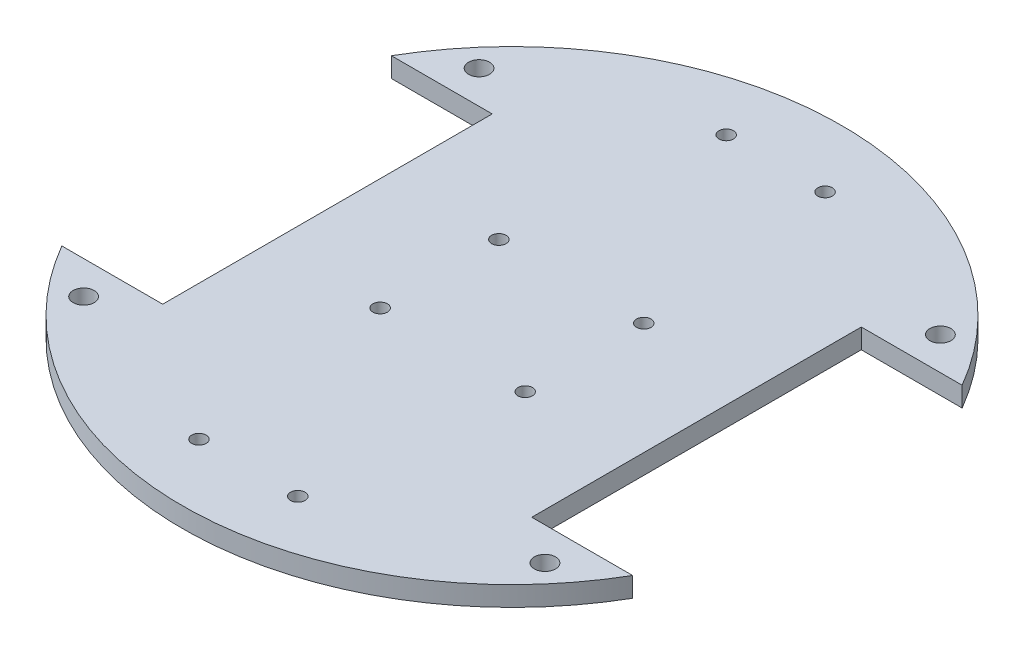
ISO-10303-21;
HEADER;
FILE_DESCRIPTION(('STEP AP214'),'2;1');
FILE_NAME('part.step','',(''),(''),'','','');
FILE_SCHEMA(('AUTOMOTIVE_DESIGN { 1 0 10303 214 1 1 1 1 }'));
ENDSEC;
DATA;
#1=APPLICATION_CONTEXT('core data for automotive mechanical design processes');
#2=APPLICATION_PROTOCOL_DEFINITION('international standard','automotive_design',2000,#1);
#3=PRODUCT_CONTEXT('',#1,'mechanical');
#4=PRODUCT('Part','Part','',(#3));
#5=PRODUCT_RELATED_PRODUCT_CATEGORY('part','',(#4));
#6=PRODUCT_DEFINITION_FORMATION('','',#4);
#7=PRODUCT_DEFINITION_CONTEXT('part definition',#1,'design');
#8=PRODUCT_DEFINITION('design','',#6,#7);
#9=PRODUCT_DEFINITION_SHAPE('','',#8);
#10=(LENGTH_UNIT() NAMED_UNIT(*) SI_UNIT(.MILLI.,.METRE.));
#11=(NAMED_UNIT(*) PLANE_ANGLE_UNIT() SI_UNIT($,.RADIAN.));
#12=(NAMED_UNIT(*) SI_UNIT($,.STERADIAN.) SOLID_ANGLE_UNIT());
#13=UNCERTAINTY_MEASURE_WITH_UNIT(LENGTH_MEASURE(1.E-05),#10,'distance_accuracy_value','');
#14=(GEOMETRIC_REPRESENTATION_CONTEXT(3) GLOBAL_UNCERTAINTY_ASSIGNED_CONTEXT((#13)) GLOBAL_UNIT_ASSIGNED_CONTEXT((#10,
#11,#12)) REPRESENTATION_CONTEXT('',''));
#15=CARTESIAN_POINT('',(0.,0.,0.));
#16=DIRECTION('',(0.,0.,1.));
#17=DIRECTION('',(1.,0.,0.));
#18=AXIS2_PLACEMENT_3D('',#15,#16,#17);
#19=CARTESIAN_POINT('',(0.,3.,0.));
#20=DIRECTION('',(0.,1.,0.));
#21=DIRECTION('',(0.,0.,1.));
#22=AXIS2_PLACEMENT_3D('',#19,#20,#21);
#23=PLANE('',#22);
#24=CARTESIAN_POINT('',(35.,3.,-30.));
#25=DIRECTION('',(0.,1.,0.));
#26=DIRECTION('',(0.,0.,-1.));
#27=AXIS2_PLACEMENT_3D('',#24,#25,#26);
#28=CIRCLE('',#27,1.59999999999999);
#29=CARTESIAN_POINT('',(35.,3.,-31.6));
#30=VERTEX_POINT('',#29);
#31=EDGE_CURVE('E285',#30,#30,#28,.T.);
#32=ORIENTED_EDGE('',*,*,#31,.F.);
#33=EDGE_LOOP('',(#32));
#34=FACE_BOUND('',#33,.T.);
#35=CARTESIAN_POINT('',(-35.,3.,-30.));
#36=DIRECTION('',(0.,1.,0.));
#37=DIRECTION('',(0.,0.,1.));
#38=AXIS2_PLACEMENT_3D('',#35,#36,#37);
#39=CIRCLE('',#38,1.6);
#40=CARTESIAN_POINT('',(-35.,3.,-28.4));
#41=VERTEX_POINT('',#40);
#42=EDGE_CURVE('E269',#41,#41,#39,.T.);
#43=ORIENTED_EDGE('',*,*,#42,.F.);
#44=EDGE_LOOP('',(#43));
#45=FACE_BOUND('',#44,.T.);
#46=CARTESIAN_POINT('',(11.,3.,9.));
#47=DIRECTION('',(0.,1.,0.));
#48=DIRECTION('',(0.,0.,1.));
#49=AXIS2_PLACEMENT_3D('',#46,#47,#48);
#50=CIRCLE('',#49,1.1);
#51=CARTESIAN_POINT('',(11.,3.,10.1));
#52=VERTEX_POINT('',#51);
#53=EDGE_CURVE('E253',#52,#52,#50,.T.);
#54=ORIENTED_EDGE('',*,*,#53,.F.);
#55=EDGE_LOOP('',(#54));
#56=FACE_BOUND('',#55,.T.);
#57=CARTESIAN_POINT('',(7.5,3.,-40.));
#58=DIRECTION('',(0.,1.,0.));
#59=DIRECTION('',(0.,0.,-1.));
#60=AXIS2_PLACEMENT_3D('',#57,#58,#59);
#61=CIRCLE('',#60,1.1);
#62=CARTESIAN_POINT('',(7.5,3.,-41.1));
#63=VERTEX_POINT('',#62);
#64=EDGE_CURVE('E237',#63,#63,#61,.T.);
#65=ORIENTED_EDGE('',*,*,#64,.F.);
#66=EDGE_LOOP('',(#65));
#67=FACE_BOUND('',#66,.T.);
#68=CARTESIAN_POINT('',(-11.,3.,9.));
#69=DIRECTION('',(0.,1.,0.));
#70=DIRECTION('',(0.,0.,-1.));
#71=AXIS2_PLACEMENT_3D('',#68,#69,#70);
#72=CIRCLE('',#71,1.1);
#73=CARTESIAN_POINT('',(-11.,3.,7.9));
#74=VERTEX_POINT('',#73);
#75=EDGE_CURVE('E221',#74,#74,#72,.T.);
#76=ORIENTED_EDGE('',*,*,#75,.F.);
#77=EDGE_LOOP('',(#76));
#78=FACE_BOUND('',#77,.T.);
#79=CARTESIAN_POINT('',(-7.5,3.,40.));
#80=DIRECTION('',(0.,1.,0.));
#81=DIRECTION('',(0.,0.,-1.));
#82=AXIS2_PLACEMENT_3D('',#79,#80,#81);
#83=CIRCLE('',#82,1.1);
#84=CARTESIAN_POINT('',(-7.5,3.,38.9));
#85=VERTEX_POINT('',#84);
#86=EDGE_CURVE('E146',#85,#85,#83,.T.);
#87=ORIENTED_EDGE('',*,*,#86,.F.);
#88=EDGE_LOOP('',(#87));
#89=FACE_BOUND('',#88,.T.);
#90=CARTESIAN_POINT('',(0.,3.,0.));
#91=DIRECTION('',(0.,1.,0.));
#92=DIRECTION('',(0.,0.,1.));
#93=AXIS2_PLACEMENT_3D('',#90,#91,#92);
#94=CIRCLE('',#93,50.);
#95=CARTESIAN_POINT('',(43.3012701892219,3.,-25.));
#96=VERTEX_POINT('',#95);
#97=CARTESIAN_POINT('',(-43.3012701892219,3.,-25.));
#98=VERTEX_POINT('',#97);
#99=EDGE_CURVE('E164',#96,#98,#94,.T.);
#100=ORIENTED_EDGE('',*,*,#99,.T.);
#101=DIRECTION('',(1.,0.,0.));
#102=VECTOR('',#101,1.);
#103=CARTESIAN_POINT('',(-28.,3.,-25.));
#104=LINE('',#103,#102);
#105=CARTESIAN_POINT('',(-28.,3.,-25.));
#106=VERTEX_POINT('',#105);
#107=EDGE_CURVE('E100',#98,#106,#104,.T.);
#108=ORIENTED_EDGE('',*,*,#107,.T.);
#109=DIRECTION('',(0.,0.,1.));
#110=VECTOR('',#109,1.);
#111=CARTESIAN_POINT('',(-28.,3.,-25.));
#112=LINE('',#111,#110);
#113=CARTESIAN_POINT('',(-28.,3.,25.));
#114=VERTEX_POINT('',#113);
#115=EDGE_CURVE('E185',#106,#114,#112,.T.);
#116=ORIENTED_EDGE('',*,*,#115,.T.);
#117=DIRECTION('',(-1.,0.,0.));
#118=VECTOR('',#117,1.);
#119=CARTESIAN_POINT('',(-28.,3.,25.));
#120=LINE('',#119,#118);
#121=CARTESIAN_POINT('',(-43.3012701892219,3.,25.));
#122=VERTEX_POINT('',#121);
#123=EDGE_CURVE('E199',#114,#122,#120,.T.);
#124=ORIENTED_EDGE('',*,*,#123,.T.);
#125=CARTESIAN_POINT('',(0.,3.,0.));
#126=DIRECTION('',(0.,1.,0.));
#127=DIRECTION('',(0.,0.,1.));
#128=AXIS2_PLACEMENT_3D('',#125,#126,#127);
#129=CIRCLE('',#128,50.);
#130=CARTESIAN_POINT('',(43.301270189222,3.,25.));
#131=VERTEX_POINT('',#130);
#132=EDGE_CURVE('E119',#122,#131,#129,.T.);
#133=ORIENTED_EDGE('',*,*,#132,.T.);
#134=DIRECTION('',(-1.,0.,0.));
#135=VECTOR('',#134,1.);
#136=CARTESIAN_POINT('',(43.301270189222,3.,25.));
#137=LINE('',#136,#135);
#138=CARTESIAN_POINT('',(28.,3.,25.));
#139=VERTEX_POINT('',#138);
#140=EDGE_CURVE('E113',#131,#139,#137,.T.);
#141=ORIENTED_EDGE('',*,*,#140,.T.);
#142=DIRECTION('',(0.,0.,-1.));
#143=VECTOR('',#142,1.);
#144=CARTESIAN_POINT('',(28.,3.,-25.));
#145=LINE('',#144,#143);
#146=CARTESIAN_POINT('',(28.,3.,-25.));
#147=VERTEX_POINT('',#146);
#148=EDGE_CURVE('E117',#139,#147,#145,.T.);
#149=ORIENTED_EDGE('',*,*,#148,.T.);
#150=DIRECTION('',(1.,0.,0.));
#151=VECTOR('',#150,1.);
#152=CARTESIAN_POINT('',(28.,3.,-25.));
#153=LINE('',#152,#151);
#154=EDGE_CURVE('E57',#147,#96,#153,.T.);
#155=ORIENTED_EDGE('',*,*,#154,.T.);
#156=EDGE_LOOP('',(#100,#108,#116,#124,#133,#141,#149,#155));
#157=FACE_BOUND('',#156,.T.);
#158=CARTESIAN_POINT('',(-11.,3.,-9.));
#159=DIRECTION('',(0.,1.,0.));
#160=DIRECTION('',(0.,0.,1.));
#161=AXIS2_PLACEMENT_3D('',#158,#159,#160);
#162=CIRCLE('',#161,1.1);
#163=CARTESIAN_POINT('',(-11.,3.,-7.9));
#164=VERTEX_POINT('',#163);
#165=EDGE_CURVE('E213',#164,#164,#162,.T.);
#166=ORIENTED_EDGE('',*,*,#165,.F.);
#167=EDGE_LOOP('',(#166));
#168=FACE_BOUND('',#167,.T.);
#169=CARTESIAN_POINT('',(7.50000000000002,3.,40.));
#170=DIRECTION('',(0.,1.,0.));
#171=DIRECTION('',(0.,0.,1.));
#172=AXIS2_PLACEMENT_3D('',#169,#170,#171);
#173=CIRCLE('',#172,1.1);
#174=CARTESIAN_POINT('',(7.50000000000002,3.,41.1));
#175=VERTEX_POINT('',#174);
#176=EDGE_CURVE('E229',#175,#175,#173,.T.);
#177=ORIENTED_EDGE('',*,*,#176,.F.);
#178=EDGE_LOOP('',(#177));
#179=FACE_BOUND('',#178,.T.);
#180=CARTESIAN_POINT('',(11.,3.,-9.));
#181=DIRECTION('',(0.,1.,0.));
#182=DIRECTION('',(0.,0.,-1.));
#183=AXIS2_PLACEMENT_3D('',#180,#181,#182);
#184=CIRCLE('',#183,1.1);
#185=CARTESIAN_POINT('',(11.,3.,-10.1));
#186=VERTEX_POINT('',#185);
#187=EDGE_CURVE('E245',#186,#186,#184,.T.);
#188=ORIENTED_EDGE('',*,*,#187,.F.);
#189=EDGE_LOOP('',(#188));
#190=FACE_BOUND('',#189,.T.);
#191=CARTESIAN_POINT('',(-7.5,3.,-40.));
#192=DIRECTION('',(0.,1.,0.));
#193=DIRECTION('',(0.,0.,1.));
#194=AXIS2_PLACEMENT_3D('',#191,#192,#193);
#195=CIRCLE('',#194,1.1);
#196=CARTESIAN_POINT('',(-7.5,3.,-38.9));
#197=VERTEX_POINT('',#196);
#198=EDGE_CURVE('E261',#197,#197,#195,.T.);
#199=ORIENTED_EDGE('',*,*,#198,.F.);
#200=EDGE_LOOP('',(#199));
#201=FACE_BOUND('',#200,.T.);
#202=CARTESIAN_POINT('',(-35.,3.,30.));
#203=DIRECTION('',(0.,1.,0.));
#204=DIRECTION('',(0.,0.,-1.));
#205=AXIS2_PLACEMENT_3D('',#202,#203,#204);
#206=CIRCLE('',#205,1.6);
#207=CARTESIAN_POINT('',(-35.,3.,28.4));
#208=VERTEX_POINT('',#207);
#209=EDGE_CURVE('E277',#208,#208,#206,.T.);
#210=ORIENTED_EDGE('',*,*,#209,.F.);
#211=EDGE_LOOP('',(#210));
#212=FACE_BOUND('',#211,.T.);
#213=CARTESIAN_POINT('',(35.,3.,30.));
#214=DIRECTION('',(0.,1.,0.));
#215=DIRECTION('',(0.,0.,1.));
#216=AXIS2_PLACEMENT_3D('',#213,#214,#215);
#217=CIRCLE('',#216,1.59999999999999);
#218=CARTESIAN_POINT('',(35.,3.,31.6));
#219=VERTEX_POINT('',#218);
#220=EDGE_CURVE('E293',#219,#219,#217,.T.);
#221=ORIENTED_EDGE('',*,*,#220,.F.);
#222=EDGE_LOOP('',(#221));
#223=FACE_BOUND('',#222,.T.);
#224=ADVANCED_FACE('F39',(#34,#45,#56,#67,#78,#89,#157,#168,#179,#190,#201,#212,#223),#23,.T.);
#225=CARTESIAN_POINT('',(0.,0.,0.));
#226=DIRECTION('',(0.,1.,0.));
#227=DIRECTION('',(0.,0.,1.));
#228=AXIS2_PLACEMENT_3D('',#225,#226,#227);
#229=PLANE('',#228);
#230=CARTESIAN_POINT('',(0.,0.,0.));
#231=DIRECTION('',(0.,1.,0.));
#232=DIRECTION('',(0.,0.,1.));
#233=AXIS2_PLACEMENT_3D('',#230,#231,#232);
#234=CIRCLE('',#233,50.);
#235=CARTESIAN_POINT('',(43.3012701892219,0.,-25.));
#236=VERTEX_POINT('',#235);
#237=CARTESIAN_POINT('',(-43.3012701892219,0.,-25.));
#238=VERTEX_POINT('',#237);
#239=EDGE_CURVE('E141',#236,#238,#234,.T.);
#240=ORIENTED_EDGE('',*,*,#239,.F.);
#241=DIRECTION('',(1.,0.,0.));
#242=VECTOR('',#241,1.);
#243=CARTESIAN_POINT('',(28.,0.,-25.));
#244=LINE('',#243,#242);
#245=CARTESIAN_POINT('',(28.,0.,-25.));
#246=VERTEX_POINT('',#245);
#247=EDGE_CURVE('E92',#246,#236,#244,.T.);
#248=ORIENTED_EDGE('',*,*,#247,.F.);
#249=DIRECTION('',(0.,0.,-1.));
#250=VECTOR('',#249,1.);
#251=CARTESIAN_POINT('',(28.,0.,-25.));
#252=LINE('',#251,#250);
#253=CARTESIAN_POINT('',(28.,0.,25.));
#254=VERTEX_POINT('',#253);
#255=EDGE_CURVE('E86',#254,#246,#252,.T.);
#256=ORIENTED_EDGE('',*,*,#255,.F.);
#257=DIRECTION('',(-1.,0.,0.));
#258=VECTOR('',#257,1.);
#259=CARTESIAN_POINT('',(43.301270189222,0.,25.));
#260=LINE('',#259,#258);
#261=CARTESIAN_POINT('',(43.301270189222,0.,25.));
#262=VERTEX_POINT('',#261);
#263=EDGE_CURVE('E128',#262,#254,#260,.T.);
#264=ORIENTED_EDGE('',*,*,#263,.F.);
#265=CARTESIAN_POINT('',(0.,0.,0.));
#266=DIRECTION('',(0.,1.,0.));
#267=DIRECTION('',(0.,0.,1.));
#268=AXIS2_PLACEMENT_3D('',#265,#266,#267);
#269=CIRCLE('',#268,50.);
#270=CARTESIAN_POINT('',(-43.3012701892219,0.,25.));
#271=VERTEX_POINT('',#270);
#272=EDGE_CURVE('E155',#271,#262,#269,.T.);
#273=ORIENTED_EDGE('',*,*,#272,.F.);
#274=DIRECTION('',(-1.,0.,0.));
#275=VECTOR('',#274,1.);
#276=CARTESIAN_POINT('',(-28.,0.,25.));
#277=LINE('',#276,#275);
#278=CARTESIAN_POINT('',(-28.,0.,25.));
#279=VERTEX_POINT('',#278);
#280=EDGE_CURVE('E152',#279,#271,#277,.T.);
#281=ORIENTED_EDGE('',*,*,#280,.F.);
#282=DIRECTION('',(0.,0.,1.));
#283=VECTOR('',#282,1.);
#284=CARTESIAN_POINT('',(-28.,0.,-25.));
#285=LINE('',#284,#283);
#286=CARTESIAN_POINT('',(-28.,0.,-25.));
#287=VERTEX_POINT('',#286);
#288=EDGE_CURVE('E149',#287,#279,#285,.T.);
#289=ORIENTED_EDGE('',*,*,#288,.F.);
#290=DIRECTION('',(1.,0.,0.));
#291=VECTOR('',#290,1.);
#292=CARTESIAN_POINT('',(-28.,0.,-25.));
#293=LINE('',#292,#291);
#294=EDGE_CURVE('E145',#238,#287,#293,.T.);
#295=ORIENTED_EDGE('',*,*,#294,.F.);
#296=EDGE_LOOP('',(#240,#248,#256,#264,#273,#281,#289,#295));
#297=FACE_BOUND('',#296,.T.);
#298=CARTESIAN_POINT('',(-7.5,0.,40.));
#299=DIRECTION('',(0.,1.,0.));
#300=DIRECTION('',(0.,0.,-1.));
#301=AXIS2_PLACEMENT_3D('',#298,#299,#300);
#302=CIRCLE('',#301,1.1);
#303=CARTESIAN_POINT('',(-7.5,0.,38.9));
#304=VERTEX_POINT('',#303);
#305=EDGE_CURVE('E209',#304,#304,#302,.T.);
#306=ORIENTED_EDGE('',*,*,#305,.T.);
#307=EDGE_LOOP('',(#306));
#308=FACE_BOUND('',#307,.T.);
#309=CARTESIAN_POINT('',(-11.,0.,-9.));
#310=DIRECTION('',(0.,1.,0.));
#311=DIRECTION('',(0.,0.,1.));
#312=AXIS2_PLACEMENT_3D('',#309,#310,#311);
#313=CIRCLE('',#312,1.1);
#314=CARTESIAN_POINT('',(-11.,0.,-7.9));
#315=VERTEX_POINT('',#314);
#316=EDGE_CURVE('E217',#315,#315,#313,.T.);
#317=ORIENTED_EDGE('',*,*,#316,.T.);
#318=EDGE_LOOP('',(#317));
#319=FACE_BOUND('',#318,.T.);
#320=CARTESIAN_POINT('',(-11.,0.,9.));
#321=DIRECTION('',(0.,1.,0.));
#322=DIRECTION('',(0.,0.,-1.));
#323=AXIS2_PLACEMENT_3D('',#320,#321,#322);
#324=CIRCLE('',#323,1.1);
#325=CARTESIAN_POINT('',(-11.,0.,7.9));
#326=VERTEX_POINT('',#325);
#327=EDGE_CURVE('E225',#326,#326,#324,.T.);
#328=ORIENTED_EDGE('',*,*,#327,.T.);
#329=EDGE_LOOP('',(#328));
#330=FACE_BOUND('',#329,.T.);
#331=CARTESIAN_POINT('',(7.50000000000002,0.,40.));
#332=DIRECTION('',(0.,1.,0.));
#333=DIRECTION('',(0.,0.,1.));
#334=AXIS2_PLACEMENT_3D('',#331,#332,#333);
#335=CIRCLE('',#334,1.1);
#336=CARTESIAN_POINT('',(7.50000000000002,0.,41.1));
#337=VERTEX_POINT('',#336);
#338=EDGE_CURVE('E233',#337,#337,#335,.T.);
#339=ORIENTED_EDGE('',*,*,#338,.T.);
#340=EDGE_LOOP('',(#339));
#341=FACE_BOUND('',#340,.T.);
#342=CARTESIAN_POINT('',(7.5,0.,-40.));
#343=DIRECTION('',(0.,1.,0.));
#344=DIRECTION('',(0.,0.,-1.));
#345=AXIS2_PLACEMENT_3D('',#342,#343,#344);
#346=CIRCLE('',#345,1.1);
#347=CARTESIAN_POINT('',(7.5,0.,-41.1));
#348=VERTEX_POINT('',#347);
#349=EDGE_CURVE('E241',#348,#348,#346,.T.);
#350=ORIENTED_EDGE('',*,*,#349,.T.);
#351=EDGE_LOOP('',(#350));
#352=FACE_BOUND('',#351,.T.);
#353=CARTESIAN_POINT('',(11.,0.,-9.));
#354=DIRECTION('',(0.,1.,0.));
#355=DIRECTION('',(0.,0.,-1.));
#356=AXIS2_PLACEMENT_3D('',#353,#354,#355);
#357=CIRCLE('',#356,1.1);
#358=CARTESIAN_POINT('',(11.,0.,-10.1));
#359=VERTEX_POINT('',#358);
#360=EDGE_CURVE('E249',#359,#359,#357,.T.);
#361=ORIENTED_EDGE('',*,*,#360,.T.);
#362=EDGE_LOOP('',(#361));
#363=FACE_BOUND('',#362,.T.);
#364=CARTESIAN_POINT('',(11.,0.,9.));
#365=DIRECTION('',(0.,1.,0.));
#366=DIRECTION('',(0.,0.,1.));
#367=AXIS2_PLACEMENT_3D('',#364,#365,#366);
#368=CIRCLE('',#367,1.1);
#369=CARTESIAN_POINT('',(11.,0.,10.1));
#370=VERTEX_POINT('',#369);
#371=EDGE_CURVE('E257',#370,#370,#368,.T.);
#372=ORIENTED_EDGE('',*,*,#371,.T.);
#373=EDGE_LOOP('',(#372));
#374=FACE_BOUND('',#373,.T.);
#375=CARTESIAN_POINT('',(-7.5,0.,-40.));
#376=DIRECTION('',(0.,1.,0.));
#377=DIRECTION('',(0.,0.,1.));
#378=AXIS2_PLACEMENT_3D('',#375,#376,#377);
#379=CIRCLE('',#378,1.1);
#380=CARTESIAN_POINT('',(-7.5,0.,-38.9));
#381=VERTEX_POINT('',#380);
#382=EDGE_CURVE('E265',#381,#381,#379,.T.);
#383=ORIENTED_EDGE('',*,*,#382,.T.);
#384=EDGE_LOOP('',(#383));
#385=FACE_BOUND('',#384,.T.);
#386=CARTESIAN_POINT('',(-35.,0.,-30.));
#387=DIRECTION('',(0.,1.,0.));
#388=DIRECTION('',(0.,0.,1.));
#389=AXIS2_PLACEMENT_3D('',#386,#387,#388);
#390=CIRCLE('',#389,1.6);
#391=CARTESIAN_POINT('',(-35.,0.,-28.4));
#392=VERTEX_POINT('',#391);
#393=EDGE_CURVE('E273',#392,#392,#390,.T.);
#394=ORIENTED_EDGE('',*,*,#393,.T.);
#395=EDGE_LOOP('',(#394));
#396=FACE_BOUND('',#395,.T.);
#397=CARTESIAN_POINT('',(-35.,0.,30.));
#398=DIRECTION('',(0.,1.,0.));
#399=DIRECTION('',(0.,0.,-1.));
#400=AXIS2_PLACEMENT_3D('',#397,#398,#399);
#401=CIRCLE('',#400,1.6);
#402=CARTESIAN_POINT('',(-35.,0.,28.4));
#403=VERTEX_POINT('',#402);
#404=EDGE_CURVE('E281',#403,#403,#401,.T.);
#405=ORIENTED_EDGE('',*,*,#404,.T.);
#406=EDGE_LOOP('',(#405));
#407=FACE_BOUND('',#406,.T.);
#408=CARTESIAN_POINT('',(35.,0.,-30.));
#409=DIRECTION('',(0.,1.,0.));
#410=DIRECTION('',(0.,0.,-1.));
#411=AXIS2_PLACEMENT_3D('',#408,#409,#410);
#412=CIRCLE('',#411,1.59999999999999);
#413=CARTESIAN_POINT('',(35.,0.,-31.6));
#414=VERTEX_POINT('',#413);
#415=EDGE_CURVE('E289',#414,#414,#412,.T.);
#416=ORIENTED_EDGE('',*,*,#415,.T.);
#417=EDGE_LOOP('',(#416));
#418=FACE_BOUND('',#417,.T.);
#419=CARTESIAN_POINT('',(35.,0.,30.));
#420=DIRECTION('',(0.,1.,0.));
#421=DIRECTION('',(0.,0.,1.));
#422=AXIS2_PLACEMENT_3D('',#419,#420,#421);
#423=CIRCLE('',#422,1.59999999999999);
#424=CARTESIAN_POINT('',(35.,0.,31.6));
#425=VERTEX_POINT('',#424);
#426=EDGE_CURVE('E297',#425,#425,#423,.T.);
#427=ORIENTED_EDGE('',*,*,#426,.T.);
#428=EDGE_LOOP('',(#427));
#429=FACE_BOUND('',#428,.T.);
#430=ADVANCED_FACE('F189',(#297,#308,#319,#330,#341,#352,#363,#374,#385,#396,#407,#418,#429),
#229,.F.);
#431=CARTESIAN_POINT('',(0.,3.,0.));
#432=DIRECTION('',(0.,-1.,0.));
#433=DIRECTION('',(0.,0.,-1.));
#434=AXIS2_PLACEMENT_3D('',#431,#432,#433);
#435=CYLINDRICAL_SURFACE('',#434,50.);
#436=ORIENTED_EDGE('',*,*,#239,.T.);
#437=DIRECTION('',(0.,-1.,0.));
#438=VECTOR('',#437,1.);
#439=CARTESIAN_POINT('',(-43.3012701892219,3.,-25.));
#440=LINE('',#439,#438);
#441=EDGE_CURVE('E11',#98,#238,#440,.T.);
#442=ORIENTED_EDGE('',*,*,#441,.F.);
#443=ORIENTED_EDGE('',*,*,#99,.F.);
#444=DIRECTION('',(0.,-1.,0.));
#445=VECTOR('',#444,1.);
#446=CARTESIAN_POINT('',(43.3012701892219,3.,-25.));
#447=LINE('',#446,#445);
#448=EDGE_CURVE('E137',#96,#236,#447,.T.);
#449=ORIENTED_EDGE('',*,*,#448,.T.);
#450=EDGE_LOOP('',(#436,#442,#443,#449));
#451=FACE_BOUND('',#450,.T.);
#452=ADVANCED_FACE('F41',(#451),#435,.T.);
#453=CARTESIAN_POINT('',(-28.,3.,-25.));
#454=DIRECTION('',(0.,0.,-1.));
#455=DIRECTION('',(-1.,0.,0.));
#456=AXIS2_PLACEMENT_3D('',#453,#454,#455);
#457=PLANE('',#456);
#458=ORIENTED_EDGE('',*,*,#294,.T.);
#459=DIRECTION('',(0.,-1.,0.));
#460=VECTOR('',#459,1.);
#461=CARTESIAN_POINT('',(-28.,3.,-25.));
#462=LINE('',#461,#460);
#463=EDGE_CURVE('E49',#106,#287,#462,.T.);
#464=ORIENTED_EDGE('',*,*,#463,.F.);
#465=ORIENTED_EDGE('',*,*,#107,.F.);
#466=ORIENTED_EDGE('',*,*,#441,.T.);
#467=EDGE_LOOP('',(#458,#464,#465,#466));
#468=FACE_BOUND('',#467,.T.);
#469=ADVANCED_FACE('F333',(#468),#457,.F.);
#470=CARTESIAN_POINT('',(-28.,3.,-25.));
#471=DIRECTION('',(1.,0.,0.));
#472=DIRECTION('',(0.,0.,-1.));
#473=AXIS2_PLACEMENT_3D('',#470,#471,#472);
#474=PLANE('',#473);
#475=ORIENTED_EDGE('',*,*,#288,.T.);
#476=DIRECTION('',(0.,-1.,0.));
#477=VECTOR('',#476,1.);
#478=CARTESIAN_POINT('',(-28.,3.,25.));
#479=LINE('',#478,#477);
#480=EDGE_CURVE('E175',#114,#279,#479,.T.);
#481=ORIENTED_EDGE('',*,*,#480,.F.);
#482=ORIENTED_EDGE('',*,*,#115,.F.);
#483=ORIENTED_EDGE('',*,*,#463,.T.);
#484=EDGE_LOOP('',(#475,#481,#482,#483));
#485=FACE_BOUND('',#484,.T.);
#486=ADVANCED_FACE('F183',(#485),#474,.F.);
#487=CARTESIAN_POINT('',(-28.,3.,25.));
#488=DIRECTION('',(0.,0.,1.));
#489=DIRECTION('',(1.,0.,0.));
#490=AXIS2_PLACEMENT_3D('',#487,#488,#489);
#491=PLANE('',#490);
#492=ORIENTED_EDGE('',*,*,#280,.T.);
#493=DIRECTION('',(0.,-1.,0.));
#494=VECTOR('',#493,1.);
#495=CARTESIAN_POINT('',(-43.3012701892219,3.,25.));
#496=LINE('',#495,#494);
#497=EDGE_CURVE('E171',#122,#271,#496,.T.);
#498=ORIENTED_EDGE('',*,*,#497,.F.);
#499=ORIENTED_EDGE('',*,*,#123,.F.);
#500=ORIENTED_EDGE('',*,*,#480,.T.);
#501=EDGE_LOOP('',(#492,#498,#499,#500));
#502=FACE_BOUND('',#501,.T.);
#503=ADVANCED_FACE('F194',(#502),#491,.F.);
#504=CARTESIAN_POINT('',(0.,3.,0.));
#505=DIRECTION('',(0.,-1.,0.));
#506=DIRECTION('',(0.,0.,-1.));
#507=AXIS2_PLACEMENT_3D('',#504,#505,#506);
#508=CYLINDRICAL_SURFACE('',#507,50.);
#509=ORIENTED_EDGE('',*,*,#272,.T.);
#510=DIRECTION('',(0.,-1.,0.));
#511=VECTOR('',#510,1.);
#512=CARTESIAN_POINT('',(43.301270189222,3.,25.));
#513=LINE('',#512,#511);
#514=EDGE_CURVE('E130',#131,#262,#513,.T.);
#515=ORIENTED_EDGE('',*,*,#514,.F.);
#516=ORIENTED_EDGE('',*,*,#132,.F.);
#517=ORIENTED_EDGE('',*,*,#497,.T.);
#518=EDGE_LOOP('',(#509,#515,#516,#517));
#519=FACE_BOUND('',#518,.T.);
#520=ADVANCED_FACE('F197',(#519),#508,.T.);
#521=CARTESIAN_POINT('',(43.301270189222,3.,25.));
#522=DIRECTION('',(0.,0.,1.));
#523=DIRECTION('',(1.,0.,0.));
#524=AXIS2_PLACEMENT_3D('',#521,#522,#523);
#525=PLANE('',#524);
#526=ORIENTED_EDGE('',*,*,#263,.T.);
#527=DIRECTION('',(0.,-1.,0.));
#528=VECTOR('',#527,1.);
#529=CARTESIAN_POINT('',(28.,3.,25.));
#530=LINE('',#529,#528);
#531=EDGE_CURVE('E125',#139,#254,#530,.T.);
#532=ORIENTED_EDGE('',*,*,#531,.F.);
#533=ORIENTED_EDGE('',*,*,#140,.F.);
#534=ORIENTED_EDGE('',*,*,#514,.T.);
#535=EDGE_LOOP('',(#526,#532,#533,#534));
#536=FACE_BOUND('',#535,.T.);
#537=ADVANCED_FACE('F126',(#536),#525,.F.);
#538=CARTESIAN_POINT('',(28.,3.,-25.));
#539=DIRECTION('',(-1.,0.,0.));
#540=DIRECTION('',(0.,0.,1.));
#541=AXIS2_PLACEMENT_3D('',#538,#539,#540);
#542=PLANE('',#541);
#543=ORIENTED_EDGE('',*,*,#255,.T.);
#544=DIRECTION('',(0.,-1.,0.));
#545=VECTOR('',#544,1.);
#546=CARTESIAN_POINT('',(28.,3.,-25.));
#547=LINE('',#546,#545);
#548=EDGE_CURVE('E131',#147,#246,#547,.T.);
#549=ORIENTED_EDGE('',*,*,#548,.F.);
#550=ORIENTED_EDGE('',*,*,#148,.F.);
#551=ORIENTED_EDGE('',*,*,#531,.T.);
#552=EDGE_LOOP('',(#543,#549,#550,#551));
#553=FACE_BOUND('',#552,.T.);
#554=ADVANCED_FACE('F133',(#553),#542,.F.);
#555=CARTESIAN_POINT('',(28.,3.,-25.));
#556=DIRECTION('',(0.,0.,-1.));
#557=DIRECTION('',(-1.,0.,0.));
#558=AXIS2_PLACEMENT_3D('',#555,#556,#557);
#559=PLANE('',#558);
#560=ORIENTED_EDGE('',*,*,#247,.T.);
#561=ORIENTED_EDGE('',*,*,#448,.F.);
#562=ORIENTED_EDGE('',*,*,#154,.F.);
#563=ORIENTED_EDGE('',*,*,#548,.T.);
#564=EDGE_LOOP('',(#560,#561,#562,#563));
#565=FACE_BOUND('',#564,.T.);
#566=ADVANCED_FACE('F321',(#565),#559,.F.);
#567=CARTESIAN_POINT('',(-7.5,3.,40.));
#568=DIRECTION('',(0.,-1.,0.));
#569=DIRECTION('',(0.,0.,-1.));
#570=AXIS2_PLACEMENT_3D('',#567,#568,#569);
#571=CYLINDRICAL_SURFACE('',#570,1.1);
#572=ORIENTED_EDGE('',*,*,#86,.T.);
#573=EDGE_LOOP('',(#572));
#574=FACE_BOUND('',#573,.T.);
#575=ORIENTED_EDGE('',*,*,#305,.F.);
#576=EDGE_LOOP('',(#575));
#577=FACE_BOUND('',#576,.T.);
#578=ADVANCED_FACE('F318',(#574,#577),#571,.F.);
#579=CARTESIAN_POINT('',(-11.,3.,-9.));
#580=DIRECTION('',(0.,-1.,0.));
#581=DIRECTION('',(0.,0.,-1.));
#582=AXIS2_PLACEMENT_3D('',#579,#580,#581);
#583=CYLINDRICAL_SURFACE('',#582,1.1);
#584=ORIENTED_EDGE('',*,*,#165,.T.);
#585=EDGE_LOOP('',(#584));
#586=FACE_BOUND('',#585,.T.);
#587=ORIENTED_EDGE('',*,*,#316,.F.);
#588=EDGE_LOOP('',(#587));
#589=FACE_BOUND('',#588,.T.);
#590=ADVANCED_FACE('F397',(#586,#589),#583,.F.);
#591=CARTESIAN_POINT('',(-11.,3.,9.));
#592=DIRECTION('',(0.,-1.,0.));
#593=DIRECTION('',(0.,0.,-1.));
#594=AXIS2_PLACEMENT_3D('',#591,#592,#593);
#595=CYLINDRICAL_SURFACE('',#594,1.1);
#596=ORIENTED_EDGE('',*,*,#75,.T.);
#597=EDGE_LOOP('',(#596));
#598=FACE_BOUND('',#597,.T.);
#599=ORIENTED_EDGE('',*,*,#327,.F.);
#600=EDGE_LOOP('',(#599));
#601=FACE_BOUND('',#600,.T.);
#602=ADVANCED_FACE('F405',(#598,#601),#595,.F.);
#603=CARTESIAN_POINT('',(7.50000000000002,3.,40.));
#604=DIRECTION('',(0.,-1.,0.));
#605=DIRECTION('',(0.,0.,-1.));
#606=AXIS2_PLACEMENT_3D('',#603,#604,#605);
#607=CYLINDRICAL_SURFACE('',#606,1.1);
#608=ORIENTED_EDGE('',*,*,#176,.T.);
#609=EDGE_LOOP('',(#608));
#610=FACE_BOUND('',#609,.T.);
#611=ORIENTED_EDGE('',*,*,#338,.F.);
#612=EDGE_LOOP('',(#611));
#613=FACE_BOUND('',#612,.T.);
#614=ADVANCED_FACE('F413',(#610,#613),#607,.F.);
#615=CARTESIAN_POINT('',(7.5,3.,-40.));
#616=DIRECTION('',(0.,-1.,0.));
#617=DIRECTION('',(0.,0.,-1.));
#618=AXIS2_PLACEMENT_3D('',#615,#616,#617);
#619=CYLINDRICAL_SURFACE('',#618,1.1);
#620=ORIENTED_EDGE('',*,*,#64,.T.);
#621=EDGE_LOOP('',(#620));
#622=FACE_BOUND('',#621,.T.);
#623=ORIENTED_EDGE('',*,*,#349,.F.);
#624=EDGE_LOOP('',(#623));
#625=FACE_BOUND('',#624,.T.);
#626=ADVANCED_FACE('F422',(#622,#625),#619,.F.);
#627=CARTESIAN_POINT('',(11.,3.,-9.));
#628=DIRECTION('',(0.,-1.,0.));
#629=DIRECTION('',(0.,0.,-1.));
#630=AXIS2_PLACEMENT_3D('',#627,#628,#629);
#631=CYLINDRICAL_SURFACE('',#630,1.1);
#632=ORIENTED_EDGE('',*,*,#187,.T.);
#633=EDGE_LOOP('',(#632));
#634=FACE_BOUND('',#633,.T.);
#635=ORIENTED_EDGE('',*,*,#360,.F.);
#636=EDGE_LOOP('',(#635));
#637=FACE_BOUND('',#636,.T.);
#638=ADVANCED_FACE('F431',(#634,#637),#631,.F.);
#639=CARTESIAN_POINT('',(11.,3.,9.));
#640=DIRECTION('',(0.,-1.,0.));
#641=DIRECTION('',(0.,0.,-1.));
#642=AXIS2_PLACEMENT_3D('',#639,#640,#641);
#643=CYLINDRICAL_SURFACE('',#642,1.1);
#644=ORIENTED_EDGE('',*,*,#53,.T.);
#645=EDGE_LOOP('',(#644));
#646=FACE_BOUND('',#645,.T.);
#647=ORIENTED_EDGE('',*,*,#371,.F.);
#648=EDGE_LOOP('',(#647));
#649=FACE_BOUND('',#648,.T.);
#650=ADVANCED_FACE('F440',(#646,#649),#643,.F.);
#651=CARTESIAN_POINT('',(-7.5,3.,-40.));
#652=DIRECTION('',(0.,-1.,0.));
#653=DIRECTION('',(0.,0.,-1.));
#654=AXIS2_PLACEMENT_3D('',#651,#652,#653);
#655=CYLINDRICAL_SURFACE('',#654,1.1);
#656=ORIENTED_EDGE('',*,*,#198,.T.);
#657=EDGE_LOOP('',(#656));
#658=FACE_BOUND('',#657,.T.);
#659=ORIENTED_EDGE('',*,*,#382,.F.);
#660=EDGE_LOOP('',(#659));
#661=FACE_BOUND('',#660,.T.);
#662=ADVANCED_FACE('F449',(#658,#661),#655,.F.);
#663=CARTESIAN_POINT('',(-35.,3.,-30.));
#664=DIRECTION('',(0.,-1.,0.));
#665=DIRECTION('',(0.,0.,-1.));
#666=AXIS2_PLACEMENT_3D('',#663,#664,#665);
#667=CYLINDRICAL_SURFACE('',#666,1.6);
#668=ORIENTED_EDGE('',*,*,#42,.T.);
#669=EDGE_LOOP('',(#668));
#670=FACE_BOUND('',#669,.T.);
#671=ORIENTED_EDGE('',*,*,#393,.F.);
#672=EDGE_LOOP('',(#671));
#673=FACE_BOUND('',#672,.T.);
#674=ADVANCED_FACE('F458',(#670,#673),#667,.F.);
#675=CARTESIAN_POINT('',(-35.,3.,30.));
#676=DIRECTION('',(0.,-1.,0.));
#677=DIRECTION('',(0.,0.,-1.));
#678=AXIS2_PLACEMENT_3D('',#675,#676,#677);
#679=CYLINDRICAL_SURFACE('',#678,1.6);
#680=ORIENTED_EDGE('',*,*,#209,.T.);
#681=EDGE_LOOP('',(#680));
#682=FACE_BOUND('',#681,.T.);
#683=ORIENTED_EDGE('',*,*,#404,.F.);
#684=EDGE_LOOP('',(#683));
#685=FACE_BOUND('',#684,.T.);
#686=ADVANCED_FACE('F467',(#682,#685),#679,.F.);
#687=CARTESIAN_POINT('',(35.,3.,-30.));
#688=DIRECTION('',(0.,-1.,0.));
#689=DIRECTION('',(0.,0.,-1.));
#690=AXIS2_PLACEMENT_3D('',#687,#688,#689);
#691=CYLINDRICAL_SURFACE('',#690,1.59999999999999);
#692=ORIENTED_EDGE('',*,*,#31,.T.);
#693=EDGE_LOOP('',(#692));
#694=FACE_BOUND('',#693,.T.);
#695=ORIENTED_EDGE('',*,*,#415,.F.);
#696=EDGE_LOOP('',(#695));
#697=FACE_BOUND('',#696,.T.);
#698=ADVANCED_FACE('F476',(#694,#697),#691,.F.);
#699=CARTESIAN_POINT('',(35.,3.,30.));
#700=DIRECTION('',(0.,-1.,0.));
#701=DIRECTION('',(0.,0.,-1.));
#702=AXIS2_PLACEMENT_3D('',#699,#700,#701);
#703=CYLINDRICAL_SURFACE('',#702,1.59999999999999);
#704=ORIENTED_EDGE('',*,*,#220,.T.);
#705=EDGE_LOOP('',(#704));
#706=FACE_BOUND('',#705,.T.);
#707=ORIENTED_EDGE('',*,*,#426,.F.);
#708=EDGE_LOOP('',(#707));
#709=FACE_BOUND('',#708,.T.);
#710=ADVANCED_FACE('F305',(#706,#709),#703,.F.);
#711=CLOSED_SHELL('',(#224,#430,#452,#469,#486,#503,#520,#537,#554,#566,#578,#590,#602,#614,
#626,#638,#650,#662,#674,#686,#698,#710));
#712=MANIFOLD_SOLID_BREP('B2',#711);
#713=ADVANCED_BREP_SHAPE_REPRESENTATION('',(#18,#712),#14);
#714=SHAPE_DEFINITION_REPRESENTATION(#9,#713);
ENDSEC;
END-ISO-10303-21;
